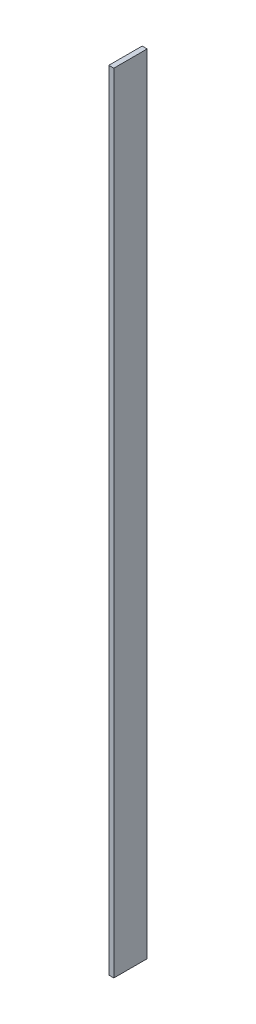
ISO-10303-21;
HEADER;
FILE_DESCRIPTION(('STEP AP214'),'2;1');
FILE_NAME('part.step','',(''),(''),'','','');
FILE_SCHEMA(('AUTOMOTIVE_DESIGN { 1 0 10303 214 1 1 1 1 }'));
ENDSEC;
DATA;
#1=APPLICATION_CONTEXT('core data for automotive mechanical design processes');
#2=APPLICATION_PROTOCOL_DEFINITION('international standard','automotive_design',2000,#1);
#3=PRODUCT_CONTEXT('',#1,'mechanical');
#4=PRODUCT('Part','Part','',(#3));
#5=PRODUCT_RELATED_PRODUCT_CATEGORY('part','',(#4));
#6=PRODUCT_DEFINITION_FORMATION('','',#4);
#7=PRODUCT_DEFINITION_CONTEXT('part definition',#1,'design');
#8=PRODUCT_DEFINITION('design','',#6,#7);
#9=PRODUCT_DEFINITION_SHAPE('','',#8);
#10=(LENGTH_UNIT() NAMED_UNIT(*) SI_UNIT(.MILLI.,.METRE.));
#11=(NAMED_UNIT(*) PLANE_ANGLE_UNIT() SI_UNIT($,.RADIAN.));
#12=(NAMED_UNIT(*) SI_UNIT($,.STERADIAN.) SOLID_ANGLE_UNIT());
#13=UNCERTAINTY_MEASURE_WITH_UNIT(LENGTH_MEASURE(1.E-05),#10,'distance_accuracy_value','');
#14=(GEOMETRIC_REPRESENTATION_CONTEXT(3) GLOBAL_UNCERTAINTY_ASSIGNED_CONTEXT((#13)) GLOBAL_UNIT_ASSIGNED_CONTEXT((#10,
#11,#12)) REPRESENTATION_CONTEXT('',''));
#15=CARTESIAN_POINT('',(0.,0.,0.));
#16=DIRECTION('',(0.,0.,1.));
#17=DIRECTION('',(1.,0.,0.));
#18=AXIS2_PLACEMENT_3D('',#15,#16,#17);
#19=CARTESIAN_POINT('',(2.38125,0.,0.));
#20=DIRECTION('',(0.,0.,-1.));
#21=DIRECTION('',(-1.,0.,0.));
#22=AXIS2_PLACEMENT_3D('',#19,#20,#21);
#23=PLANE('',#22);
#24=DIRECTION('',(0.,-1.,0.));
#25=VECTOR('',#24,1.);
#26=CARTESIAN_POINT('',(0.,0.,0.));
#27=LINE('',#26,#25);
#28=CARTESIAN_POINT('',(0.,374.65,0.));
#29=VERTEX_POINT('',#28);
#30=CARTESIAN_POINT('',(0.,0.,0.));
#31=VERTEX_POINT('',#30);
#32=EDGE_CURVE('E96',#29,#31,#27,.T.);
#33=ORIENTED_EDGE('',*,*,#32,.T.);
#34=DIRECTION('',(-1.,0.,0.));
#35=VECTOR('',#34,1.);
#36=CARTESIAN_POINT('',(2.38125,0.,0.));
#37=LINE('',#36,#35);
#38=CARTESIAN_POINT('',(2.38125,0.,0.));
#39=VERTEX_POINT('',#38);
#40=EDGE_CURVE('E11',#39,#31,#37,.T.);
#41=ORIENTED_EDGE('',*,*,#40,.F.);
#42=DIRECTION('',(0.,-1.,0.));
#43=VECTOR('',#42,1.);
#44=CARTESIAN_POINT('',(2.38125,0.,0.));
#45=LINE('',#44,#43);
#46=CARTESIAN_POINT('',(2.38125,374.65,0.));
#47=VERTEX_POINT('',#46);
#48=EDGE_CURVE('E84',#47,#39,#45,.T.);
#49=ORIENTED_EDGE('',*,*,#48,.F.);
#50=DIRECTION('',(-1.,0.,0.));
#51=VECTOR('',#50,1.);
#52=CARTESIAN_POINT('',(2.38125,374.65,0.));
#53=LINE('',#52,#51);
#54=EDGE_CURVE('E92',#47,#29,#53,.T.);
#55=ORIENTED_EDGE('',*,*,#54,.T.);
#56=EDGE_LOOP('',(#33,#41,#49,#55));
#57=FACE_BOUND('',#56,.T.);
#58=ADVANCED_FACE('F33',(#57),#23,.F.);
#59=CARTESIAN_POINT('',(2.38125,0.,0.));
#60=DIRECTION('',(0.,1.,0.));
#61=DIRECTION('',(0.,0.,1.));
#62=AXIS2_PLACEMENT_3D('',#59,#60,#61);
#63=PLANE('',#62);
#64=DIRECTION('',(0.,0.,-1.));
#65=VECTOR('',#64,1.);
#66=CARTESIAN_POINT('',(0.,0.,0.));
#67=LINE('',#66,#65);
#68=CARTESIAN_POINT('',(0.,0.,-15.875));
#69=VERTEX_POINT('',#68);
#70=EDGE_CURVE('E88',#31,#69,#67,.T.);
#71=ORIENTED_EDGE('',*,*,#70,.T.);
#72=DIRECTION('',(-1.,0.,0.));
#73=VECTOR('',#72,1.);
#74=CARTESIAN_POINT('',(2.38125,0.,-15.875));
#75=LINE('',#74,#73);
#76=CARTESIAN_POINT('',(2.38125,0.,-15.875));
#77=VERTEX_POINT('',#76);
#78=EDGE_CURVE('E41',#77,#69,#75,.T.);
#79=ORIENTED_EDGE('',*,*,#78,.F.);
#80=DIRECTION('',(0.,0.,-1.));
#81=VECTOR('',#80,1.);
#82=CARTESIAN_POINT('',(2.38125,0.,0.));
#83=LINE('',#82,#81);
#84=EDGE_CURVE('E79',#39,#77,#83,.T.);
#85=ORIENTED_EDGE('',*,*,#84,.F.);
#86=ORIENTED_EDGE('',*,*,#40,.T.);
#87=EDGE_LOOP('',(#71,#79,#85,#86));
#88=FACE_BOUND('',#87,.T.);
#89=ADVANCED_FACE('F87',(#88),#63,.F.);
#90=CARTESIAN_POINT('',(2.38125,0.,-15.875));
#91=DIRECTION('',(0.,0.,1.));
#92=DIRECTION('',(1.,0.,0.));
#93=AXIS2_PLACEMENT_3D('',#90,#91,#92);
#94=PLANE('',#93);
#95=DIRECTION('',(0.,1.,0.));
#96=VECTOR('',#95,1.);
#97=CARTESIAN_POINT('',(0.,0.,-15.875));
#98=LINE('',#97,#96);
#99=CARTESIAN_POINT('',(0.,374.65,-15.875));
#100=VERTEX_POINT('',#99);
#101=EDGE_CURVE('E66',#69,#100,#98,.T.);
#102=ORIENTED_EDGE('',*,*,#101,.T.);
#103=DIRECTION('',(-1.,0.,0.));
#104=VECTOR('',#103,1.);
#105=CARTESIAN_POINT('',(2.38125,374.65,-15.875));
#106=LINE('',#105,#104);
#107=CARTESIAN_POINT('',(2.38125,374.65,-15.875));
#108=VERTEX_POINT('',#107);
#109=EDGE_CURVE('E89',#108,#100,#106,.T.);
#110=ORIENTED_EDGE('',*,*,#109,.F.);
#111=DIRECTION('',(0.,1.,0.));
#112=VECTOR('',#111,1.);
#113=CARTESIAN_POINT('',(2.38125,0.,-15.875));
#114=LINE('',#113,#112);
#115=EDGE_CURVE('E82',#77,#108,#114,.T.);
#116=ORIENTED_EDGE('',*,*,#115,.F.);
#117=ORIENTED_EDGE('',*,*,#78,.T.);
#118=EDGE_LOOP('',(#102,#110,#116,#117));
#119=FACE_BOUND('',#118,.T.);
#120=ADVANCED_FACE('F90',(#119),#94,.F.);
#121=CARTESIAN_POINT('',(2.38125,374.65,0.));
#122=DIRECTION('',(0.,-1.,0.));
#123=DIRECTION('',(0.,0.,-1.));
#124=AXIS2_PLACEMENT_3D('',#121,#122,#123);
#125=PLANE('',#124);
#126=DIRECTION('',(0.,0.,1.));
#127=VECTOR('',#126,1.);
#128=CARTESIAN_POINT('',(0.,374.65,0.));
#129=LINE('',#128,#127);
#130=EDGE_CURVE('E72',#100,#29,#129,.T.);
#131=ORIENTED_EDGE('',*,*,#130,.T.);
#132=ORIENTED_EDGE('',*,*,#54,.F.);
#133=DIRECTION('',(0.,0.,1.));
#134=VECTOR('',#133,1.);
#135=CARTESIAN_POINT('',(2.38125,374.65,0.));
#136=LINE('',#135,#134);
#137=EDGE_CURVE('E49',#108,#47,#136,.T.);
#138=ORIENTED_EDGE('',*,*,#137,.F.);
#139=ORIENTED_EDGE('',*,*,#109,.T.);
#140=EDGE_LOOP('',(#131,#132,#138,#139));
#141=FACE_BOUND('',#140,.T.);
#142=ADVANCED_FACE('F103',(#141),#125,.F.);
#143=CARTESIAN_POINT('',(2.38125,0.,0.));
#144=DIRECTION('',(-1.,0.,0.));
#145=DIRECTION('',(0.,0.,1.));
#146=AXIS2_PLACEMENT_3D('',#143,#144,#145);
#147=PLANE('',#146);
#148=ORIENTED_EDGE('',*,*,#48,.T.);
#149=ORIENTED_EDGE('',*,*,#84,.T.);
#150=ORIENTED_EDGE('',*,*,#115,.T.);
#151=ORIENTED_EDGE('',*,*,#137,.T.);
#152=EDGE_LOOP('',(#148,#149,#150,#151));
#153=FACE_BOUND('',#152,.T.);
#154=ADVANCED_FACE('F80',(#153),#147,.F.);
#155=CARTESIAN_POINT('',(0.,0.,0.));
#156=DIRECTION('',(-1.,0.,0.));
#157=DIRECTION('',(0.,0.,1.));
#158=AXIS2_PLACEMENT_3D('',#155,#156,#157);
#159=PLANE('',#158);
#160=ORIENTED_EDGE('',*,*,#32,.F.);
#161=ORIENTED_EDGE('',*,*,#130,.F.);
#162=ORIENTED_EDGE('',*,*,#101,.F.);
#163=ORIENTED_EDGE('',*,*,#70,.F.);
#164=EDGE_LOOP('',(#160,#161,#162,#163));
#165=FACE_BOUND('',#164,.T.);
#166=ADVANCED_FACE('F106',(#165),#159,.T.);
#167=CLOSED_SHELL('',(#58,#89,#120,#142,#154,#166));
#168=MANIFOLD_SOLID_BREP('B2',#167);
#169=ADVANCED_BREP_SHAPE_REPRESENTATION('',(#18,#168),#14);
#170=SHAPE_DEFINITION_REPRESENTATION(#9,#169);
ENDSEC;
END-ISO-10303-21;
